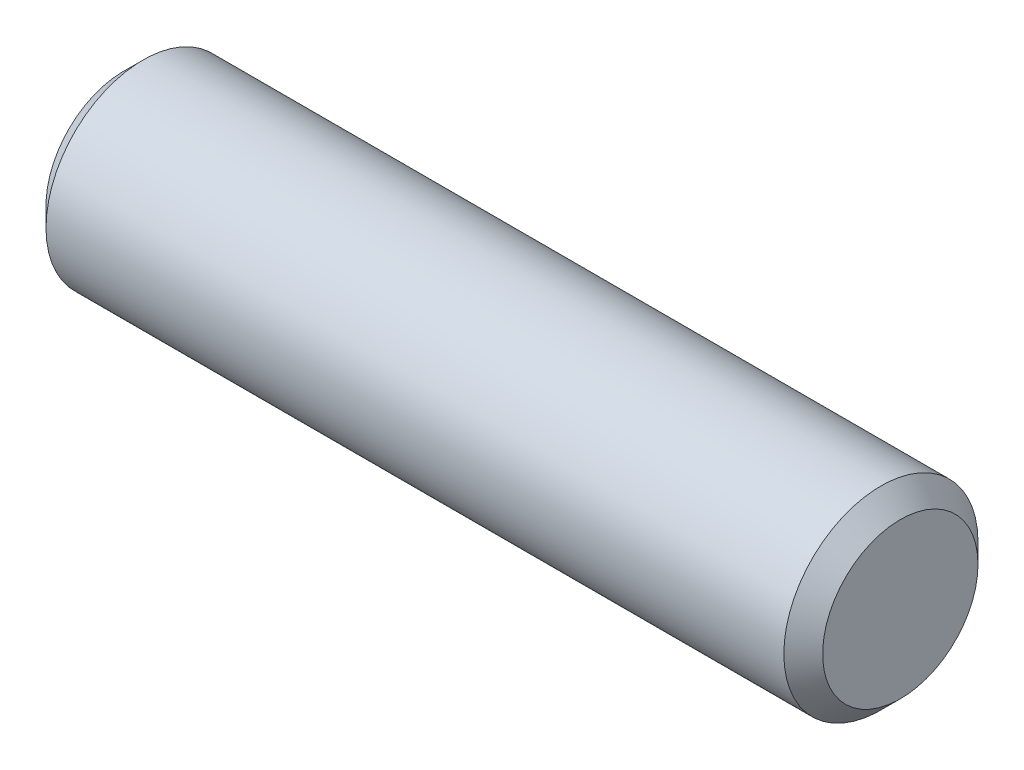
ISO-10303-21;
HEADER;
FILE_DESCRIPTION(('STEP AP214'),'2;1');
FILE_NAME('part.step','',(''),(''),'','','');
FILE_SCHEMA(('AUTOMOTIVE_DESIGN { 1 0 10303 214 1 1 1 1 }'));
ENDSEC;
DATA;
#1=APPLICATION_CONTEXT('core data for automotive mechanical design processes');
#2=APPLICATION_PROTOCOL_DEFINITION('international standard','automotive_design',2000,#1);
#3=PRODUCT_CONTEXT('',#1,'mechanical');
#4=PRODUCT('Part','Part','',(#3));
#5=PRODUCT_RELATED_PRODUCT_CATEGORY('part','',(#4));
#6=PRODUCT_DEFINITION_FORMATION('','',#4);
#7=PRODUCT_DEFINITION_CONTEXT('part definition',#1,'design');
#8=PRODUCT_DEFINITION('design','',#6,#7);
#9=PRODUCT_DEFINITION_SHAPE('','',#8);
#10=(LENGTH_UNIT() NAMED_UNIT(*) SI_UNIT(.MILLI.,.METRE.));
#11=(NAMED_UNIT(*) PLANE_ANGLE_UNIT() SI_UNIT($,.RADIAN.));
#12=(NAMED_UNIT(*) SI_UNIT($,.STERADIAN.) SOLID_ANGLE_UNIT());
#13=UNCERTAINTY_MEASURE_WITH_UNIT(LENGTH_MEASURE(1.E-05),#10,'distance_accuracy_value','');
#14=(GEOMETRIC_REPRESENTATION_CONTEXT(3) GLOBAL_UNCERTAINTY_ASSIGNED_CONTEXT((#13)) GLOBAL_UNIT_ASSIGNED_CONTEXT((#10,
#11,#12)) REPRESENTATION_CONTEXT('',''));
#15=CARTESIAN_POINT('',(0.,0.,0.));
#16=DIRECTION('',(0.,0.,1.));
#17=DIRECTION('',(1.,0.,0.));
#18=AXIS2_PLACEMENT_3D('',#15,#16,#17);
#19=CARTESIAN_POINT('',(-3.175,0.,0.));
#20=DIRECTION('',(1.,0.,0.));
#21=DIRECTION('',(0.,0.,-1.));
#22=AXIS2_PLACEMENT_3D('',#19,#20,#21);
#23=CYLINDRICAL_SURFACE('',#22,0.79375);
#24=CARTESIAN_POINT('',(3.01625,0.,0.));
#25=DIRECTION('',(1.,0.,0.));
#26=DIRECTION('',(0.,0.,-1.));
#27=AXIS2_PLACEMENT_3D('',#24,#25,#26);
#28=CIRCLE('',#27,0.79375);
#29=CARTESIAN_POINT('',(3.01625,0.,-0.79375));
#30=VERTEX_POINT('',#29);
#31=EDGE_CURVE('E37',#30,#30,#28,.F.);
#32=ORIENTED_EDGE('',*,*,#31,.T.);
#33=EDGE_LOOP('',(#32));
#34=FACE_BOUND('',#33,.T.);
#35=CARTESIAN_POINT('',(-3.01625,0.,0.));
#36=DIRECTION('',(1.,0.,0.));
#37=DIRECTION('',(0.,0.,-1.));
#38=AXIS2_PLACEMENT_3D('',#35,#36,#37);
#39=CIRCLE('',#38,0.79375);
#40=CARTESIAN_POINT('',(-3.01625,0.,-0.79375));
#41=VERTEX_POINT('',#40);
#42=EDGE_CURVE('E41',#41,#41,#39,.T.);
#43=ORIENTED_EDGE('',*,*,#42,.T.);
#44=EDGE_LOOP('',(#43));
#45=FACE_BOUND('',#44,.T.);
#46=ADVANCED_FACE('F30',(#34,#45),#23,.T.);
#47=CARTESIAN_POINT('',(-3.175,0.,0.));
#48=DIRECTION('',(1.,0.,0.));
#49=DIRECTION('',(0.,0.,-1.));
#50=AXIS2_PLACEMENT_3D('',#47,#48,#49);
#51=PLANE('',#50);
#52=CARTESIAN_POINT('',(-3.175,0.,0.));
#53=DIRECTION('',(1.,0.,0.));
#54=DIRECTION('',(0.,0.,-1.));
#55=AXIS2_PLACEMENT_3D('',#52,#53,#54);
#56=CIRCLE('',#55,0.635);
#57=CARTESIAN_POINT('',(-3.175,0.,-0.635));
#58=VERTEX_POINT('',#57);
#59=EDGE_CURVE('E10',#58,#58,#56,.F.);
#60=ORIENTED_EDGE('',*,*,#59,.T.);
#61=EDGE_LOOP('',(#60));
#62=FACE_BOUND('',#61,.T.);
#63=ADVANCED_FACE('F61',(#62),#51,.F.);
#64=CARTESIAN_POINT('',(3.175,0.,0.));
#65=DIRECTION('',(1.,0.,0.));
#66=DIRECTION('',(0.,0.,-1.));
#67=AXIS2_PLACEMENT_3D('',#64,#65,#66);
#68=PLANE('',#67);
#69=CARTESIAN_POINT('',(3.175,0.,0.));
#70=DIRECTION('',(1.,0.,0.));
#71=DIRECTION('',(0.,0.,-1.));
#72=AXIS2_PLACEMENT_3D('',#69,#70,#71);
#73=CIRCLE('',#72,0.635000000000001);
#74=CARTESIAN_POINT('',(3.175,0.,-0.635000000000001));
#75=VERTEX_POINT('',#74);
#76=EDGE_CURVE('E45',#75,#75,#73,.T.);
#77=ORIENTED_EDGE('',*,*,#76,.T.);
#78=EDGE_LOOP('',(#77));
#79=FACE_BOUND('',#78,.T.);
#80=ADVANCED_FACE('F51',(#79),#68,.T.);
#81=CARTESIAN_POINT('',(3.175,0.,0.));
#82=DIRECTION('',(-1.,0.,0.));
#83=DIRECTION('',(0.,0.,1.));
#84=AXIS2_PLACEMENT_3D('',#81,#82,#83);
#85=CONICAL_SURFACE('',#84,0.635000000000001,0.785398163397445);
#86=ORIENTED_EDGE('',*,*,#31,.F.);
#87=EDGE_LOOP('',(#86));
#88=FACE_BOUND('',#87,.T.);
#89=ORIENTED_EDGE('',*,*,#76,.F.);
#90=EDGE_LOOP('',(#89));
#91=FACE_BOUND('',#90,.T.);
#92=ADVANCED_FACE('F53',(#88,#91),#85,.T.);
#93=CARTESIAN_POINT('',(-3.01625,0.,0.));
#94=DIRECTION('',(1.,0.,0.));
#95=DIRECTION('',(0.,0.,-1.));
#96=AXIS2_PLACEMENT_3D('',#93,#94,#95);
#97=CONICAL_SURFACE('',#96,0.79375,0.785398163397448);
#98=ORIENTED_EDGE('',*,*,#59,.F.);
#99=EDGE_LOOP('',(#98));
#100=FACE_BOUND('',#99,.T.);
#101=ORIENTED_EDGE('',*,*,#42,.F.);
#102=EDGE_LOOP('',(#101));
#103=FACE_BOUND('',#102,.T.);
#104=ADVANCED_FACE('F32',(#100,#103),#97,.T.);
#105=CLOSED_SHELL('',(#46,#63,#80,#92,#104));
#106=MANIFOLD_SOLID_BREP('B2',#105);
#107=ADVANCED_BREP_SHAPE_REPRESENTATION('',(#18,#106),#14);
#108=SHAPE_DEFINITION_REPRESENTATION(#9,#107);
ENDSEC;
END-ISO-10303-21;
